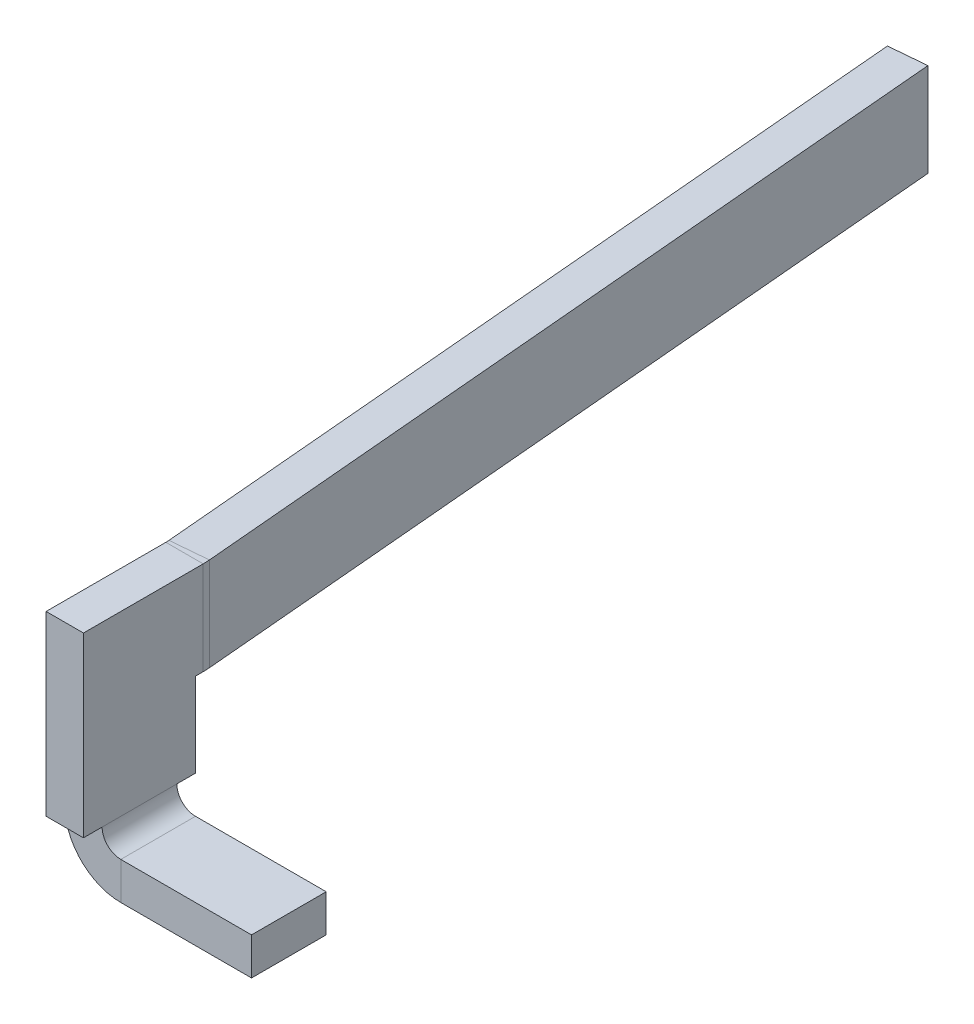
ISO-10303-21;
HEADER;
FILE_DESCRIPTION(('STEP AP214'),'2;1');
FILE_NAME('part.step','',(''),(''),'','','');
FILE_SCHEMA(('AUTOMOTIVE_DESIGN { 1 0 10303 214 1 1 1 1 }'));
ENDSEC;
DATA;
#1=APPLICATION_CONTEXT('core data for automotive mechanical design processes');
#2=APPLICATION_PROTOCOL_DEFINITION('international standard','automotive_design',2000,#1);
#3=PRODUCT_CONTEXT('',#1,'mechanical');
#4=PRODUCT('Part','Part','',(#3));
#5=PRODUCT_RELATED_PRODUCT_CATEGORY('part','',(#4));
#6=PRODUCT_DEFINITION_FORMATION('','',#4);
#7=PRODUCT_DEFINITION_CONTEXT('part definition',#1,'design');
#8=PRODUCT_DEFINITION('design','',#6,#7);
#9=PRODUCT_DEFINITION_SHAPE('','',#8);
#10=(LENGTH_UNIT() NAMED_UNIT(*) SI_UNIT(.MILLI.,.METRE.));
#11=(NAMED_UNIT(*) PLANE_ANGLE_UNIT() SI_UNIT($,.RADIAN.));
#12=(NAMED_UNIT(*) SI_UNIT($,.STERADIAN.) SOLID_ANGLE_UNIT());
#13=UNCERTAINTY_MEASURE_WITH_UNIT(LENGTH_MEASURE(1.E-05),#10,'distance_accuracy_value','');
#14=(GEOMETRIC_REPRESENTATION_CONTEXT(3) GLOBAL_UNCERTAINTY_ASSIGNED_CONTEXT((#13)) GLOBAL_UNIT_ASSIGNED_CONTEXT((#10,
#11,#12)) REPRESENTATION_CONTEXT('',''));
#15=CARTESIAN_POINT('',(0.,0.,0.));
#16=DIRECTION('',(0.,0.,1.));
#17=DIRECTION('',(1.,0.,0.));
#18=AXIS2_PLACEMENT_3D('',#15,#16,#17);
#19=CARTESIAN_POINT('',(5.,0.725,-0.324999998635131));
#20=DIRECTION('',(1.,0.,0.));
#21=DIRECTION('',(0.,1.,0.));
#22=AXIS2_PLACEMENT_3D('',#19,#20,#21);
#23=PLANE('',#22);
#24=DIRECTION('',(0.,0.,1.));
#25=VECTOR('',#24,1.);
#26=CARTESIAN_POINT('',(5.,0.3,-0.162499999078714));
#27=LINE('',#26,#25);
#28=CARTESIAN_POINT('',(5.,0.3,-0.600000000341217));
#29=VERTEX_POINT('',#28);
#30=CARTESIAN_POINT('',(5.,0.3,-0.5));
#31=VERTEX_POINT('',#30);
#32=EDGE_CURVE('E112',#29,#31,#27,.T.);
#33=ORIENTED_EDGE('',*,*,#32,.T.);
#34=DIRECTION('',(0.,0.,1.));
#35=VECTOR('',#34,1.);
#36=CARTESIAN_POINT('',(5.,0.3,-0.162499999078714));
#37=LINE('',#36,#35);
#38=CARTESIAN_POINT('',(5.,0.3,-0.1));
#39=VERTEX_POINT('',#38);
#40=EDGE_CURVE('E247',#31,#39,#37,.T.);
#41=ORIENTED_EDGE('',*,*,#40,.T.);
#42=DIRECTION('',(0.,0.,1.));
#43=VECTOR('',#42,1.);
#44=CARTESIAN_POINT('',(5.,0.3,-0.162499999078714));
#45=LINE('',#44,#43);
#46=CARTESIAN_POINT('',(5.,0.3,4.7770405686709E-10));
#47=VERTEX_POINT('',#46);
#48=EDGE_CURVE('E253',#39,#47,#45,.T.);
#49=ORIENTED_EDGE('',*,*,#48,.T.);
#50=DIRECTION('',(0.,1.,2.72973850988512E-09));
#51=VECTOR('',#50,1.);
#52=CARTESIAN_POINT('',(5.,0.250000000000005,3.41217115326642E-10));
#53=LINE('',#52,#51);
#54=CARTESIAN_POINT('',(5.,1.25,3.07095562521176E-09));
#55=VERTEX_POINT('',#54);
#56=EDGE_CURVE('E173',#47,#55,#53,.T.);
#57=ORIENTED_EDGE('',*,*,#56,.T.);
#58=DIRECTION('',(0.,0.,-1.));
#59=VECTOR('',#58,1.);
#60=CARTESIAN_POINT('',(5.,1.25,3.07095562521176E-09));
#61=LINE('',#60,#59);
#62=CARTESIAN_POINT('',(5.,1.25,-0.641267811759518));
#63=VERTEX_POINT('',#62);
#64=EDGE_CURVE('E27',#55,#63,#61,.T.);
#65=ORIENTED_EDGE('',*,*,#64,.T.);
#66=DIRECTION('',(0.,-1.,0.));
#67=VECTOR('',#66,1.);
#68=CARTESIAN_POINT('',(5.,0.9875,-0.641267811759518));
#69=LINE('',#68,#67);
#70=CARTESIAN_POINT('',(5.,0.75,-0.641267811759518));
#71=VERTEX_POINT('',#70);
#72=EDGE_CURVE('E170',#63,#71,#69,.T.);
#73=ORIENTED_EDGE('',*,*,#72,.T.);
#74=DIRECTION('',(0.,0.,1.));
#75=VECTOR('',#74,1.);
#76=CARTESIAN_POINT('',(5.,0.75,-0.650000000341217));
#77=LINE('',#76,#75);
#78=CARTESIAN_POINT('',(5.,0.75,-0.600000000341217));
#79=VERTEX_POINT('',#78);
#80=EDGE_CURVE('E179',#71,#79,#77,.T.);
#81=ORIENTED_EDGE('',*,*,#80,.T.);
#82=DIRECTION('',(0.,-1.,0.));
#83=VECTOR('',#82,1.);
#84=CARTESIAN_POINT('',(5.,0.75,-0.600000000341217));
#85=LINE('',#84,#83);
#86=EDGE_CURVE('E11',#79,#29,#85,.T.);
#87=ORIENTED_EDGE('',*,*,#86,.T.);
#88=EDGE_LOOP('',(#33,#41,#49,#57,#65,#73,#81,#87));
#89=FACE_BOUND('',#88,.T.);
#90=ADVANCED_FACE('F16',(#89),#23,.F.);
#91=CARTESIAN_POINT('',(5.,0.249999999999991,-0.600000000341217));
#92=DIRECTION('',(0.,0.,-1.));
#93=DIRECTION('',(0.,-1.,0.));
#94=AXIS2_PLACEMENT_3D('',#91,#92,#93);
#95=PLANE('',#94);
#96=DIRECTION('',(-1.,0.,0.));
#97=VECTOR('',#96,1.);
#98=CARTESIAN_POINT('',(5.1,0.3,-0.600000000341217));
#99=LINE('',#98,#97);
#100=CARTESIAN_POINT('',(5.2,0.3,-0.600000000341217));
#101=VERTEX_POINT('',#100);
#102=EDGE_CURVE('E262',#101,#29,#99,.T.);
#103=ORIENTED_EDGE('',*,*,#102,.T.);
#104=ORIENTED_EDGE('',*,*,#86,.F.);
#105=DIRECTION('',(1.,0.,0.));
#106=VECTOR('',#105,1.);
#107=CARTESIAN_POINT('',(5.,0.75,-0.600000000341217));
#108=LINE('',#107,#106);
#109=CARTESIAN_POINT('',(5.2,0.75,-0.600000000341217));
#110=VERTEX_POINT('',#109);
#111=EDGE_CURVE('E190',#79,#110,#108,.T.);
#112=ORIENTED_EDGE('',*,*,#111,.T.);
#113=DIRECTION('',(0.,1.,0.));
#114=VECTOR('',#113,1.);
#115=CARTESIAN_POINT('',(5.2,0.75,-0.600000000341217));
#116=LINE('',#115,#114);
#117=EDGE_CURVE('E325',#101,#110,#116,.T.);
#118=ORIENTED_EDGE('',*,*,#117,.F.);
#119=EDGE_LOOP('',(#103,#104,#112,#118));
#120=FACE_BOUND('',#119,.T.);
#121=ADVANCED_FACE('F812',(#120),#95,.T.);
#122=CARTESIAN_POINT('',(5.,1.25,-0.650000000341218));
#123=DIRECTION('',(0.,1.,0.));
#124=DIRECTION('',(1.,0.,0.));
#125=AXIS2_PLACEMENT_3D('',#122,#123,#124);
#126=PLANE('',#125);
#127=DIRECTION('',(-1.,0.,0.));
#128=VECTOR('',#127,1.);
#129=CARTESIAN_POINT('',(5.,1.25,-0.641267811759518));
#130=LINE('',#129,#128);
#131=CARTESIAN_POINT('',(5.2,1.25,-0.641267811759518));
#132=VERTEX_POINT('',#131);
#133=EDGE_CURVE('E194',#132,#63,#130,.T.);
#134=ORIENTED_EDGE('',*,*,#133,.T.);
#135=ORIENTED_EDGE('',*,*,#64,.F.);
#136=DIRECTION('',(1.,0.,0.));
#137=VECTOR('',#136,1.);
#138=CARTESIAN_POINT('',(5.,1.25,3.07095562521176E-09));
#139=LINE('',#138,#137);
#140=CARTESIAN_POINT('',(5.2,1.25,3.07095564255899E-09));
#141=VERTEX_POINT('',#140);
#142=EDGE_CURVE('E223',#55,#141,#139,.T.);
#143=ORIENTED_EDGE('',*,*,#142,.T.);
#144=DIRECTION('',(0.,0.,1.));
#145=VECTOR('',#144,1.);
#146=CARTESIAN_POINT('',(5.2,1.25,3.07095562521176E-09));
#147=LINE('',#146,#145);
#148=EDGE_CURVE('E196',#132,#141,#147,.T.);
#149=ORIENTED_EDGE('',*,*,#148,.F.);
#150=EDGE_LOOP('',(#134,#135,#143,#149));
#151=FACE_BOUND('',#150,.T.);
#152=ADVANCED_FACE('F195',(#151),#126,.T.);
#153=CARTESIAN_POINT('',(5.,0.75,-0.600000000341217));
#154=DIRECTION('',(0.,-1.,0.));
#155=DIRECTION('',(0.,0.,-1.));
#156=AXIS2_PLACEMENT_3D('',#153,#154,#155);
#157=PLANE('',#156);
#158=DIRECTION('',(1.,0.,0.));
#159=VECTOR('',#158,1.);
#160=CARTESIAN_POINT('',(5.,0.75,-0.641267811759518));
#161=LINE('',#160,#159);
#162=CARTESIAN_POINT('',(5.2,0.75,-0.641267811759518));
#163=VERTEX_POINT('',#162);
#164=EDGE_CURVE('E202',#71,#163,#161,.T.);
#165=ORIENTED_EDGE('',*,*,#164,.T.);
#166=DIRECTION('',(0.,0.,-1.));
#167=VECTOR('',#166,1.);
#168=CARTESIAN_POINT('',(5.2,0.75,-0.650000000341217));
#169=LINE('',#168,#167);
#170=EDGE_CURVE('E329',#110,#163,#169,.T.);
#171=ORIENTED_EDGE('',*,*,#170,.F.);
#172=ORIENTED_EDGE('',*,*,#111,.F.);
#173=ORIENTED_EDGE('',*,*,#80,.F.);
#174=EDGE_LOOP('',(#165,#171,#172,#173));
#175=FACE_BOUND('',#174,.T.);
#176=ADVANCED_FACE('F794',(#175),#157,.T.);
#177=CARTESIAN_POINT('',(5.01502173681703,1.,-2.77304341197851));
#178=DIRECTION('',(0.996194698091747,0.,-0.0871557427476466));
#179=DIRECTION('',(0.,-1.,0.));
#180=AXIS2_PLACEMENT_3D('',#177,#178,#179);
#181=PLANE('',#180);
#182=DIRECTION('',(0.,-1.,0.));
#183=VECTOR('',#182,1.);
#184=CARTESIAN_POINT('',(5.1984778792367,1.,-0.676130108858576));
#185=LINE('',#184,#183);
#186=CARTESIAN_POINT('',(5.1984778792367,1.25,-0.676130108858576));
#187=VERTEX_POINT('',#186);
#188=CARTESIAN_POINT('',(5.1984778792367,0.75,-0.676130108858576));
#189=VERTEX_POINT('',#188);
#190=EDGE_CURVE('E271',#187,#189,#185,.T.);
#191=ORIENTED_EDGE('',*,*,#190,.T.);
#192=DIRECTION('',(-0.0871557427476458,0.,-0.996194698091747));
#193=VECTOR('',#192,1.);
#194=CARTESIAN_POINT('',(5.26966791793158,0.75,0.137575756859659));
#195=LINE('',#194,#193);
#196=CARTESIAN_POINT('',(4.8295880933225,0.75,-4.89255965581284));
#197=VERTEX_POINT('',#196);
#198=EDGE_CURVE('E237',#189,#197,#195,.T.);
#199=ORIENTED_EDGE('',*,*,#198,.T.);
#200=DIRECTION('',(0.,1.,0.));
#201=VECTOR('',#200,1.);
#202=CARTESIAN_POINT('',(4.8295880933225,1.25,-4.89255965581284));
#203=LINE('',#202,#201);
#204=CARTESIAN_POINT('',(4.8295880933225,1.25,-4.89255965581284));
#205=VERTEX_POINT('',#204);
#206=EDGE_CURVE('E191',#197,#205,#203,.T.);
#207=ORIENTED_EDGE('',*,*,#206,.T.);
#208=DIRECTION('',(0.0871557427476466,0.,0.996194698091746));
#209=VECTOR('',#208,1.);
#210=CARTESIAN_POINT('',(5.1984778792367,1.25,-0.676130108858576));
#211=LINE('',#210,#209);
#212=EDGE_CURVE('E221',#205,#187,#211,.T.);
#213=ORIENTED_EDGE('',*,*,#212,.T.);
#214=EDGE_LOOP('',(#191,#199,#207,#213));
#215=FACE_BOUND('',#214,.T.);
#216=ADVANCED_FACE('F390',(#215),#181,.T.);
#217=CARTESIAN_POINT('',(4.8,1.,-0.641267811759518));
#218=DIRECTION('',(0.,1.,0.));
#219=DIRECTION('',(1.,0.,0.));
#220=AXIS2_PLACEMENT_3D('',#217,#218,#219);
#221=CYLINDRICAL_SURFACE('',#220,0.2);
#222=DIRECTION('',(0.,1.,0.));
#223=VECTOR('',#222,1.);
#224=CARTESIAN_POINT('',(4.99923893961835,1.,-0.658698960309047));
#225=LINE('',#224,#223);
#226=CARTESIAN_POINT('',(4.99923893961835,0.75,-0.658698960309047));
#227=VERTEX_POINT('',#226);
#228=CARTESIAN_POINT('',(4.99923893961835,1.25,-0.658698960309047));
#229=VERTEX_POINT('',#228);
#230=EDGE_CURVE('E232',#227,#229,#225,.T.);
#231=ORIENTED_EDGE('',*,*,#230,.F.);
#232=CARTESIAN_POINT('',(4.8,0.75,-0.641267811759517));
#233=DIRECTION('',(0.,-1.,0.));
#234=DIRECTION('',(0.996194698091746,0.,-0.0871557427476472));
#235=AXIS2_PLACEMENT_3D('',#232,#233,#234);
#236=CIRCLE('',#235,0.2);
#237=EDGE_CURVE('E187',#227,#71,#236,.T.);
#238=ORIENTED_EDGE('',*,*,#237,.T.);
#239=ORIENTED_EDGE('',*,*,#72,.F.);
#240=CARTESIAN_POINT('',(4.8,1.25,-0.641267811759518));
#241=DIRECTION('',(0.,-1.,0.));
#242=DIRECTION('',(0.996194698091747,0.,-0.0871557427476462));
#243=AXIS2_PLACEMENT_3D('',#240,#241,#242);
#244=CIRCLE('',#243,0.2);
#245=EDGE_CURVE('E185',#229,#63,#244,.T.);
#246=ORIENTED_EDGE('',*,*,#245,.F.);
#247=EDGE_LOOP('',(#231,#238,#239,#246));
#248=FACE_BOUND('',#247,.T.);
#249=ADVANCED_FACE('F183',(#248),#221,.F.);
#250=CARTESIAN_POINT('',(4.63034915370416,0.75,-4.87512850726331));
#251=DIRECTION('',(-0.0871557427476466,0.,-0.996194698091747));
#252=DIRECTION('',(-0.996194698091747,0.,0.0871557427476466));
#253=AXIS2_PLACEMENT_3D('',#250,#251,#252);
#254=PLANE('',#253);
#255=DIRECTION('',(0.,-1.,0.));
#256=VECTOR('',#255,1.);
#257=CARTESIAN_POINT('',(4.63034915370415,1.25,-4.87512850726331));
#258=LINE('',#257,#256);
#259=CARTESIAN_POINT('',(4.63034915370415,1.25,-4.87512850726331));
#260=VERTEX_POINT('',#259);
#261=CARTESIAN_POINT('',(4.63034915370416,0.75,-4.87512850726331));
#262=VERTEX_POINT('',#261);
#263=EDGE_CURVE('E214',#260,#262,#258,.T.);
#264=ORIENTED_EDGE('',*,*,#263,.F.);
#265=DIRECTION('',(0.996194698091746,0.,-0.0871557427476466));
#266=VECTOR('',#265,1.);
#267=CARTESIAN_POINT('',(4.63034915370415,1.25,-4.87512850726331));
#268=LINE('',#267,#266);
#269=EDGE_CURVE('E275',#260,#205,#268,.T.);
#270=ORIENTED_EDGE('',*,*,#269,.T.);
#271=ORIENTED_EDGE('',*,*,#206,.F.);
#272=DIRECTION('',(0.996194698091746,0.,-0.0871557427476466));
#273=VECTOR('',#272,1.);
#274=CARTESIAN_POINT('',(4.63034915370416,0.75,-4.87512850726331));
#275=LINE('',#274,#273);
#276=EDGE_CURVE('E259',#262,#197,#275,.T.);
#277=ORIENTED_EDGE('',*,*,#276,.F.);
#278=EDGE_LOOP('',(#264,#270,#271,#277));
#279=FACE_BOUND('',#278,.T.);
#280=ADVANCED_FACE('F768',(#279),#254,.T.);
#281=CARTESIAN_POINT('',(4.63034915370415,1.25,-4.87512850726331));
#282=DIRECTION('',(0.,1.,0.));
#283=DIRECTION('',(0.,0.,-1.));
#284=AXIS2_PLACEMENT_3D('',#281,#282,#283);
#285=PLANE('',#284);
#286=DIRECTION('',(0.996194698091746,0.,-0.0871557427476466));
#287=VECTOR('',#286,1.);
#288=CARTESIAN_POINT('',(5.0291247805611,1.25,-0.661313632591476));
#289=LINE('',#288,#287);
#290=EDGE_CURVE('E206',#229,#187,#289,.T.);
#291=ORIENTED_EDGE('',*,*,#290,.T.);
#292=ORIENTED_EDGE('',*,*,#212,.F.);
#293=ORIENTED_EDGE('',*,*,#269,.F.);
#294=DIRECTION('',(0.0871557427476463,0.,0.996194698091747));
#295=VECTOR('',#294,1.);
#296=CARTESIAN_POINT('',(5.07042897831323,1.25,0.155006905409188));
#297=LINE('',#296,#295);
#298=EDGE_CURVE('E236',#260,#229,#297,.T.);
#299=ORIENTED_EDGE('',*,*,#298,.T.);
#300=EDGE_LOOP('',(#291,#292,#293,#299));
#301=FACE_BOUND('',#300,.T.);
#302=ADVANCED_FACE('F759',(#301),#285,.T.);
#303=CARTESIAN_POINT('',(5.1984778792367,0.75,-0.676130108858576));
#304=DIRECTION('',(0.,-1.,0.));
#305=DIRECTION('',(-1.,0.,0.));
#306=AXIS2_PLACEMENT_3D('',#303,#304,#305);
#307=PLANE('',#306);
#308=DIRECTION('',(-0.996194698091746,0.,0.0871557427476466));
#309=VECTOR('',#308,1.);
#310=CARTESIAN_POINT('',(5.0291247805611,0.75,-0.661313632591476));
#311=LINE('',#310,#309);
#312=EDGE_CURVE('E230',#189,#227,#311,.T.);
#313=ORIENTED_EDGE('',*,*,#312,.F.);
#314=CARTESIAN_POINT('',(4.8,0.75,-0.641267811759517));
#315=DIRECTION('',(0.,1.,0.));
#316=DIRECTION('',(1.,0.,0.));
#317=AXIS2_PLACEMENT_3D('',#314,#315,#316);
#318=CIRCLE('',#317,0.4);
#319=EDGE_CURVE('E226',#163,#189,#318,.T.);
#320=ORIENTED_EDGE('',*,*,#319,.F.);
#321=ORIENTED_EDGE('',*,*,#164,.F.);
#322=ORIENTED_EDGE('',*,*,#237,.F.);
#323=EDGE_LOOP('',(#313,#320,#321,#322));
#324=FACE_BOUND('',#323,.T.);
#325=ADVANCED_FACE('F382',(#324),#307,.T.);
#326=CARTESIAN_POINT('',(4.99923893961835,1.25,-0.658698960309047));
#327=DIRECTION('',(0.,1.,0.));
#328=DIRECTION('',(0.,0.,-1.));
#329=AXIS2_PLACEMENT_3D('',#326,#327,#328);
#330=PLANE('',#329);
#331=ORIENTED_EDGE('',*,*,#290,.F.);
#332=ORIENTED_EDGE('',*,*,#245,.T.);
#333=ORIENTED_EDGE('',*,*,#133,.F.);
#334=CARTESIAN_POINT('',(4.8,1.25,-0.641267811759518));
#335=DIRECTION('',(0.,-1.,0.));
#336=DIRECTION('',(0.996194698091747,0.,-0.0871557427476463));
#337=AXIS2_PLACEMENT_3D('',#334,#335,#336);
#338=CIRCLE('',#337,0.4);
#339=EDGE_CURVE('E231',#187,#132,#338,.T.);
#340=ORIENTED_EDGE('',*,*,#339,.F.);
#341=EDGE_LOOP('',(#331,#332,#333,#340));
#342=FACE_BOUND('',#341,.T.);
#343=ADVANCED_FACE('F204',(#342),#330,.T.);
#344=CARTESIAN_POINT('',(4.81578279719868,1.,-2.75561226342898));
#345=DIRECTION('',(0.996194698091747,0.,-0.0871557427476463));
#346=DIRECTION('',(0.,-1.,0.));
#347=AXIS2_PLACEMENT_3D('',#344,#345,#346);
#348=PLANE('',#347);
#349=ORIENTED_EDGE('',*,*,#230,.T.);
#350=ORIENTED_EDGE('',*,*,#298,.F.);
#351=ORIENTED_EDGE('',*,*,#263,.T.);
#352=DIRECTION('',(0.0871557427476458,0.,0.996194698091747));
#353=VECTOR('',#352,1.);
#354=CARTESIAN_POINT('',(5.07042897831323,0.75,0.155006905409188));
#355=LINE('',#354,#353);
#356=EDGE_CURVE('E255',#262,#227,#355,.T.);
#357=ORIENTED_EDGE('',*,*,#356,.T.);
#358=EDGE_LOOP('',(#349,#350,#351,#357));
#359=FACE_BOUND('',#358,.T.);
#360=ADVANCED_FACE('F733',(#359),#348,.F.);
#361=CARTESIAN_POINT('',(5.00121644069321,0.75,-0.636096019594655));
#362=DIRECTION('',(0.,-1.,0.));
#363=DIRECTION('',(-1.,0.,0.));
#364=AXIS2_PLACEMENT_3D('',#361,#362,#363);
#365=PLANE('',#364);
#366=ORIENTED_EDGE('',*,*,#312,.T.);
#367=ORIENTED_EDGE('',*,*,#356,.F.);
#368=ORIENTED_EDGE('',*,*,#276,.T.);
#369=ORIENTED_EDGE('',*,*,#198,.F.);
#370=EDGE_LOOP('',(#366,#367,#368,#369));
#371=FACE_BOUND('',#370,.T.);
#372=ADVANCED_FACE('F379',(#371),#365,.T.);
#373=CARTESIAN_POINT('',(4.8,1.,-0.641267811759518));
#374=DIRECTION('',(0.,1.,0.));
#375=DIRECTION('',(1.,0.,0.));
#376=AXIS2_PLACEMENT_3D('',#373,#374,#375);
#377=CYLINDRICAL_SURFACE('',#376,0.4);
#378=ORIENTED_EDGE('',*,*,#190,.F.);
#379=ORIENTED_EDGE('',*,*,#339,.T.);
#380=DIRECTION('',(0.,1.,0.));
#381=VECTOR('',#380,1.);
#382=CARTESIAN_POINT('',(5.2,0.9875,-0.641267811759518));
#383=LINE('',#382,#381);
#384=EDGE_CURVE('E272',#163,#132,#383,.T.);
#385=ORIENTED_EDGE('',*,*,#384,.F.);
#386=ORIENTED_EDGE('',*,*,#319,.T.);
#387=EDGE_LOOP('',(#378,#379,#385,#386));
#388=FACE_BOUND('',#387,.T.);
#389=ADVANCED_FACE('F387',(#388),#377,.T.);
#390=CARTESIAN_POINT('',(5.2,0.725,-0.324999998635131));
#391=DIRECTION('',(1.,0.,0.));
#392=DIRECTION('',(0.,1.,0.));
#393=AXIS2_PLACEMENT_3D('',#390,#391,#392);
#394=PLANE('',#393);
#395=DIRECTION('',(0.,0.,-1.));
#396=VECTOR('',#395,1.);
#397=CARTESIAN_POINT('',(5.2,0.3,-0.162499999078714));
#398=LINE('',#397,#396);
#399=CARTESIAN_POINT('',(5.2,0.3,4.7770405686709E-10));
#400=VERTEX_POINT('',#399);
#401=CARTESIAN_POINT('',(5.2,0.3,-0.1));
#402=VERTEX_POINT('',#401);
#403=EDGE_CURVE('E254',#400,#402,#398,.T.);
#404=ORIENTED_EDGE('',*,*,#403,.T.);
#405=DIRECTION('',(0.,0.,-1.));
#406=VECTOR('',#405,1.);
#407=CARTESIAN_POINT('',(5.2,0.3,-0.162499999078714));
#408=LINE('',#407,#406);
#409=CARTESIAN_POINT('',(5.2,0.3,-0.5));
#410=VERTEX_POINT('',#409);
#411=EDGE_CURVE('E263',#402,#410,#408,.T.);
#412=ORIENTED_EDGE('',*,*,#411,.T.);
#413=DIRECTION('',(0.,0.,-1.));
#414=VECTOR('',#413,1.);
#415=CARTESIAN_POINT('',(5.2,0.3,-0.162499999078714));
#416=LINE('',#415,#414);
#417=EDGE_CURVE('E293',#410,#101,#416,.T.);
#418=ORIENTED_EDGE('',*,*,#417,.T.);
#419=ORIENTED_EDGE('',*,*,#117,.T.);
#420=ORIENTED_EDGE('',*,*,#170,.T.);
#421=ORIENTED_EDGE('',*,*,#384,.T.);
#422=ORIENTED_EDGE('',*,*,#148,.T.);
#423=DIRECTION('',(0.,-1.,-2.72973850988512E-09));
#424=VECTOR('',#423,1.);
#425=CARTESIAN_POINT('',(5.2,0.250000000000005,3.41217115326642E-10));
#426=LINE('',#425,#424);
#427=EDGE_CURVE('E218',#141,#400,#426,.T.);
#428=ORIENTED_EDGE('',*,*,#427,.T.);
#429=EDGE_LOOP('',(#404,#412,#418,#419,#420,#421,#422,#428));
#430=FACE_BOUND('',#429,.T.);
#431=ADVANCED_FACE('F18',(#430),#394,.T.);
#432=CARTESIAN_POINT('',(5.,1.25,3.07095562521176E-09));
#433=DIRECTION('',(0.,-2.72973850988512E-09,1.));
#434=DIRECTION('',(-1.,0.,0.));
#435=AXIS2_PLACEMENT_3D('',#432,#433,#434);
#436=PLANE('',#435);
#437=DIRECTION('',(1.,0.,0.));
#438=VECTOR('',#437,1.);
#439=CARTESIAN_POINT('',(5.1,0.3,4.77704040820881E-10));
#440=LINE('',#439,#438);
#441=EDGE_CURVE('E249',#47,#400,#440,.T.);
#442=ORIENTED_EDGE('',*,*,#441,.T.);
#443=ORIENTED_EDGE('',*,*,#427,.F.);
#444=ORIENTED_EDGE('',*,*,#142,.F.);
#445=ORIENTED_EDGE('',*,*,#56,.F.);
#446=EDGE_LOOP('',(#442,#443,#444,#445));
#447=FACE_BOUND('',#446,.T.);
#448=ADVANCED_FACE('F694',(#447),#436,.T.);
#449=CARTESIAN_POINT('',(5.2,0.3,4.7770405686709E-10));
#450=DIRECTION('',(0.,1.,0.));
#451=DIRECTION('',(0.,0.,-1.));
#452=AXIS2_PLACEMENT_3D('',#449,#450,#451);
#453=PLANE('',#452);
#454=DIRECTION('',(1.,0.,0.));
#455=VECTOR('',#454,1.);
#456=CARTESIAN_POINT('',(5.25,0.3,-0.1));
#457=LINE('',#456,#455);
#458=EDGE_CURVE('E284',#39,#402,#457,.T.);
#459=ORIENTED_EDGE('',*,*,#458,.T.);
#460=ORIENTED_EDGE('',*,*,#403,.F.);
#461=ORIENTED_EDGE('',*,*,#441,.F.);
#462=ORIENTED_EDGE('',*,*,#48,.F.);
#463=EDGE_LOOP('',(#459,#460,#461,#462));
#464=FACE_BOUND('',#463,.T.);
#465=ADVANCED_FACE('F684',(#464),#453,.F.);
#466=CARTESIAN_POINT('',(5.2,0.3,4.7770405686709E-10));
#467=DIRECTION('',(0.,1.,0.));
#468=DIRECTION('',(0.,0.,-1.));
#469=AXIS2_PLACEMENT_3D('',#466,#467,#468);
#470=PLANE('',#469);
#471=DIRECTION('',(-1.,0.,0.));
#472=VECTOR('',#471,1.);
#473=CARTESIAN_POINT('',(5.25,0.3,-0.5));
#474=LINE('',#473,#472);
#475=EDGE_CURVE('E281',#410,#31,#474,.T.);
#476=ORIENTED_EDGE('',*,*,#475,.T.);
#477=ORIENTED_EDGE('',*,*,#32,.F.);
#478=ORIENTED_EDGE('',*,*,#102,.F.);
#479=ORIENTED_EDGE('',*,*,#417,.F.);
#480=EDGE_LOOP('',(#476,#477,#478,#479));
#481=FACE_BOUND('',#480,.T.);
#482=ADVANCED_FACE('F674',(#481),#470,.F.);
#483=CARTESIAN_POINT('',(5.52433629385641,0.,-0.3));
#484=DIRECTION('',(0.,-1.,0.));
#485=DIRECTION('',(0.,0.,-1.));
#486=AXIS2_PLACEMENT_3D('',#483,#484,#485);
#487=PLANE('',#486);
#488=DIRECTION('',(0.,0.,-1.));
#489=VECTOR('',#488,1.);
#490=CARTESIAN_POINT('',(5.3,0.,-0.3));
#491=LINE('',#490,#489);
#492=CARTESIAN_POINT('',(5.3,0.,-0.1));
#493=VERTEX_POINT('',#492);
#494=CARTESIAN_POINT('',(5.3,0.,-0.5));
#495=VERTEX_POINT('',#494);
#496=EDGE_CURVE('E248',#493,#495,#491,.T.);
#497=ORIENTED_EDGE('',*,*,#496,.T.);
#498=DIRECTION('',(1.,0.,0.));
#499=VECTOR('',#498,1.);
#500=CARTESIAN_POINT('',(4.79734517542563,0.,-0.5));
#501=LINE('',#500,#499);
#502=CARTESIAN_POINT('',(6.,0.,-0.5));
#503=VERTEX_POINT('',#502);
#504=EDGE_CURVE('E290',#495,#503,#501,.T.);
#505=ORIENTED_EDGE('',*,*,#504,.T.);
#506=DIRECTION('',(0.,0.,1.));
#507=VECTOR('',#506,1.);
#508=CARTESIAN_POINT('',(6.,0.,-0.1));
#509=LINE('',#508,#507);
#510=CARTESIAN_POINT('',(6.,0.,-0.1));
#511=VERTEX_POINT('',#510);
#512=EDGE_CURVE('E305',#503,#511,#509,.T.);
#513=ORIENTED_EDGE('',*,*,#512,.T.);
#514=DIRECTION('',(-1.,0.,0.));
#515=VECTOR('',#514,1.);
#516=CARTESIAN_POINT('',(5.3,0.,-0.1));
#517=LINE('',#516,#515);
#518=EDGE_CURVE('E302',#511,#493,#517,.T.);
#519=ORIENTED_EDGE('',*,*,#518,.T.);
#520=EDGE_LOOP('',(#497,#505,#513,#519));
#521=FACE_BOUND('',#520,.T.);
#522=ADVANCED_FACE('F440',(#521),#487,.T.);
#523=CARTESIAN_POINT('',(5.3,0.3,-0.3));
#524=DIRECTION('',(0.,0.,1.));
#525=DIRECTION('',(-1.,0.,0.));
#526=AXIS2_PLACEMENT_3D('',#523,#524,#525);
#527=CYLINDRICAL_SURFACE('',#526,0.1);
#528=DIRECTION('',(0.,0.,1.));
#529=VECTOR('',#528,1.);
#530=CARTESIAN_POINT('',(5.3,0.2,-0.3));
#531=LINE('',#530,#529);
#532=CARTESIAN_POINT('',(5.3,0.2,-0.5));
#533=VERTEX_POINT('',#532);
#534=CARTESIAN_POINT('',(5.3,0.2,-0.1));
#535=VERTEX_POINT('',#534);
#536=EDGE_CURVE('E334',#533,#535,#531,.T.);
#537=ORIENTED_EDGE('',*,*,#536,.F.);
#538=CARTESIAN_POINT('',(5.3,0.3,-0.5));
#539=DIRECTION('',(0.,0.,-1.));
#540=DIRECTION('',(0.,-1.,0.));
#541=AXIS2_PLACEMENT_3D('',#538,#539,#540);
#542=CIRCLE('',#541,0.1);
#543=EDGE_CURVE('E100',#533,#410,#542,.T.);
#544=ORIENTED_EDGE('',*,*,#543,.T.);
#545=ORIENTED_EDGE('',*,*,#411,.F.);
#546=CARTESIAN_POINT('',(5.3,0.3,-0.1));
#547=DIRECTION('',(0.,0.,-1.));
#548=DIRECTION('',(0.,-1.,0.));
#549=AXIS2_PLACEMENT_3D('',#546,#547,#548);
#550=CIRCLE('',#549,0.1);
#551=EDGE_CURVE('E300',#535,#402,#550,.T.);
#552=ORIENTED_EDGE('',*,*,#551,.F.);
#553=EDGE_LOOP('',(#537,#544,#545,#552));
#554=FACE_BOUND('',#553,.T.);
#555=ADVANCED_FACE('F412',(#554),#527,.F.);
#556=CARTESIAN_POINT('',(6.,0.2,-0.5));
#557=DIRECTION('',(1.,0.,0.));
#558=DIRECTION('',(0.,0.,-1.));
#559=AXIS2_PLACEMENT_3D('',#556,#557,#558);
#560=PLANE('',#559);
#561=DIRECTION('',(0.,0.,-1.));
#562=VECTOR('',#561,1.);
#563=CARTESIAN_POINT('',(6.,0.2,-0.1));
#564=LINE('',#563,#562);
#565=CARTESIAN_POINT('',(6.,0.2,-0.1));
#566=VERTEX_POINT('',#565);
#567=CARTESIAN_POINT('',(6.,0.2,-0.5));
#568=VERTEX_POINT('',#567);
#569=EDGE_CURVE('E264',#566,#568,#564,.T.);
#570=ORIENTED_EDGE('',*,*,#569,.F.);
#571=DIRECTION('',(0.,-1.,0.));
#572=VECTOR('',#571,1.);
#573=CARTESIAN_POINT('',(6.,0.2,-0.1));
#574=LINE('',#573,#572);
#575=EDGE_CURVE('E313',#566,#511,#574,.T.);
#576=ORIENTED_EDGE('',*,*,#575,.T.);
#577=ORIENTED_EDGE('',*,*,#512,.F.);
#578=DIRECTION('',(0.,-1.,0.));
#579=VECTOR('',#578,1.);
#580=CARTESIAN_POINT('',(6.,0.2,-0.5));
#581=LINE('',#580,#579);
#582=EDGE_CURVE('E242',#568,#503,#581,.T.);
#583=ORIENTED_EDGE('',*,*,#582,.F.);
#584=EDGE_LOOP('',(#570,#576,#577,#583));
#585=FACE_BOUND('',#584,.T.);
#586=ADVANCED_FACE('F426',(#585),#560,.T.);
#587=CARTESIAN_POINT('',(6.,0.2,-0.1));
#588=DIRECTION('',(0.,0.,1.));
#589=DIRECTION('',(0.,-1.,0.));
#590=AXIS2_PLACEMENT_3D('',#587,#588,#589);
#591=PLANE('',#590);
#592=DIRECTION('',(0.,-1.,0.));
#593=VECTOR('',#592,1.);
#594=CARTESIAN_POINT('',(5.3,0.17,-0.1));
#595=LINE('',#594,#593);
#596=EDGE_CURVE('E267',#535,#493,#595,.T.);
#597=ORIENTED_EDGE('',*,*,#596,.T.);
#598=ORIENTED_EDGE('',*,*,#518,.F.);
#599=ORIENTED_EDGE('',*,*,#575,.F.);
#600=DIRECTION('',(-1.,0.,0.));
#601=VECTOR('',#600,1.);
#602=CARTESIAN_POINT('',(4.79734517542563,0.2,-0.1));
#603=LINE('',#602,#601);
#604=EDGE_CURVE('E268',#566,#535,#603,.T.);
#605=ORIENTED_EDGE('',*,*,#604,.T.);
#606=EDGE_LOOP('',(#597,#598,#599,#605));
#607=FACE_BOUND('',#606,.T.);
#608=ADVANCED_FACE('F422',(#607),#591,.T.);
#609=CARTESIAN_POINT('',(5.3,0.,-0.5));
#610=DIRECTION('',(0.,0.,-1.));
#611=DIRECTION('',(-1.,0.,0.));
#612=AXIS2_PLACEMENT_3D('',#609,#610,#611);
#613=PLANE('',#612);
#614=DIRECTION('',(0.,1.,0.));
#615=VECTOR('',#614,1.);
#616=CARTESIAN_POINT('',(5.3,0.17,-0.5));
#617=LINE('',#616,#615);
#618=EDGE_CURVE('E20',#495,#533,#617,.T.);
#619=ORIENTED_EDGE('',*,*,#618,.F.);
#620=CARTESIAN_POINT('',(5.3,0.3,-0.5));
#621=DIRECTION('',(0.,0.,1.));
#622=DIRECTION('',(-1.,0.,0.));
#623=AXIS2_PLACEMENT_3D('',#620,#621,#622);
#624=CIRCLE('',#623,0.3);
#625=EDGE_CURVE('E296',#31,#495,#624,.T.);
#626=ORIENTED_EDGE('',*,*,#625,.F.);
#627=ORIENTED_EDGE('',*,*,#475,.F.);
#628=ORIENTED_EDGE('',*,*,#543,.F.);
#629=EDGE_LOOP('',(#619,#626,#627,#628));
#630=FACE_BOUND('',#629,.T.);
#631=ADVANCED_FACE('F622',(#630),#613,.T.);
#632=CARTESIAN_POINT('',(5.3,0.2,-0.1));
#633=DIRECTION('',(0.,0.,1.));
#634=DIRECTION('',(0.,-1.,0.));
#635=AXIS2_PLACEMENT_3D('',#632,#633,#634);
#636=PLANE('',#635);
#637=ORIENTED_EDGE('',*,*,#596,.F.);
#638=ORIENTED_EDGE('',*,*,#551,.T.);
#639=ORIENTED_EDGE('',*,*,#458,.F.);
#640=CARTESIAN_POINT('',(5.3,0.3,-0.1));
#641=DIRECTION('',(0.,0.,-1.));
#642=DIRECTION('',(0.,-1.,0.));
#643=AXIS2_PLACEMENT_3D('',#640,#641,#642);
#644=CIRCLE('',#643,0.3);
#645=EDGE_CURVE('E243',#493,#39,#644,.T.);
#646=ORIENTED_EDGE('',*,*,#645,.F.);
#647=EDGE_LOOP('',(#637,#638,#639,#646));
#648=FACE_BOUND('',#647,.T.);
#649=ADVANCED_FACE('F417',(#648),#636,.T.);
#650=CARTESIAN_POINT('',(5.52433629385641,0.2,-0.3));
#651=DIRECTION('',(0.,1.,0.));
#652=DIRECTION('',(0.,0.,-1.));
#653=AXIS2_PLACEMENT_3D('',#650,#651,#652);
#654=PLANE('',#653);
#655=ORIENTED_EDGE('',*,*,#536,.T.);
#656=ORIENTED_EDGE('',*,*,#604,.F.);
#657=ORIENTED_EDGE('',*,*,#569,.T.);
#658=DIRECTION('',(-1.,0.,0.));
#659=VECTOR('',#658,1.);
#660=CARTESIAN_POINT('',(4.79734517542563,0.2,-0.5));
#661=LINE('',#660,#659);
#662=EDGE_CURVE('E238',#568,#533,#661,.T.);
#663=ORIENTED_EDGE('',*,*,#662,.T.);
#664=EDGE_LOOP('',(#655,#656,#657,#663));
#665=FACE_BOUND('',#664,.T.);
#666=ADVANCED_FACE('F408',(#665),#654,.T.);
#667=CARTESIAN_POINT('',(5.04867258771282,0.2,-0.5));
#668=DIRECTION('',(0.,0.,-1.));
#669=DIRECTION('',(-1.,0.,0.));
#670=AXIS2_PLACEMENT_3D('',#667,#668,#669);
#671=PLANE('',#670);
#672=ORIENTED_EDGE('',*,*,#618,.T.);
#673=ORIENTED_EDGE('',*,*,#662,.F.);
#674=ORIENTED_EDGE('',*,*,#582,.T.);
#675=ORIENTED_EDGE('',*,*,#504,.F.);
#676=EDGE_LOOP('',(#672,#673,#674,#675));
#677=FACE_BOUND('',#676,.T.);
#678=ADVANCED_FACE('F428',(#677),#671,.T.);
#679=CARTESIAN_POINT('',(5.3,0.3,-0.3));
#680=DIRECTION('',(0.,0.,1.));
#681=DIRECTION('',(-1.,0.,0.));
#682=AXIS2_PLACEMENT_3D('',#679,#680,#681);
#683=CYLINDRICAL_SURFACE('',#682,0.3);
#684=ORIENTED_EDGE('',*,*,#496,.F.);
#685=ORIENTED_EDGE('',*,*,#645,.T.);
#686=ORIENTED_EDGE('',*,*,#40,.F.);
#687=ORIENTED_EDGE('',*,*,#625,.T.);
#688=EDGE_LOOP('',(#684,#685,#686,#687));
#689=FACE_BOUND('',#688,.T.);
#690=ADVANCED_FACE('F439',(#689),#683,.T.);
#691=CLOSED_SHELL('',(#90,#121,#152,#176,#216,#249,#280,#302,#325,#343,#360,#372,#389,#431,#448,
#465,#482,#522,#555,#586,#608,#631,#649,#666,#678,#690));
#692=MANIFOLD_SOLID_BREP('B1',#691);
#693=ADVANCED_BREP_SHAPE_REPRESENTATION('',(#18,#692),#14);
#694=SHAPE_DEFINITION_REPRESENTATION(#9,#693);
ENDSEC;
END-ISO-10303-21;
